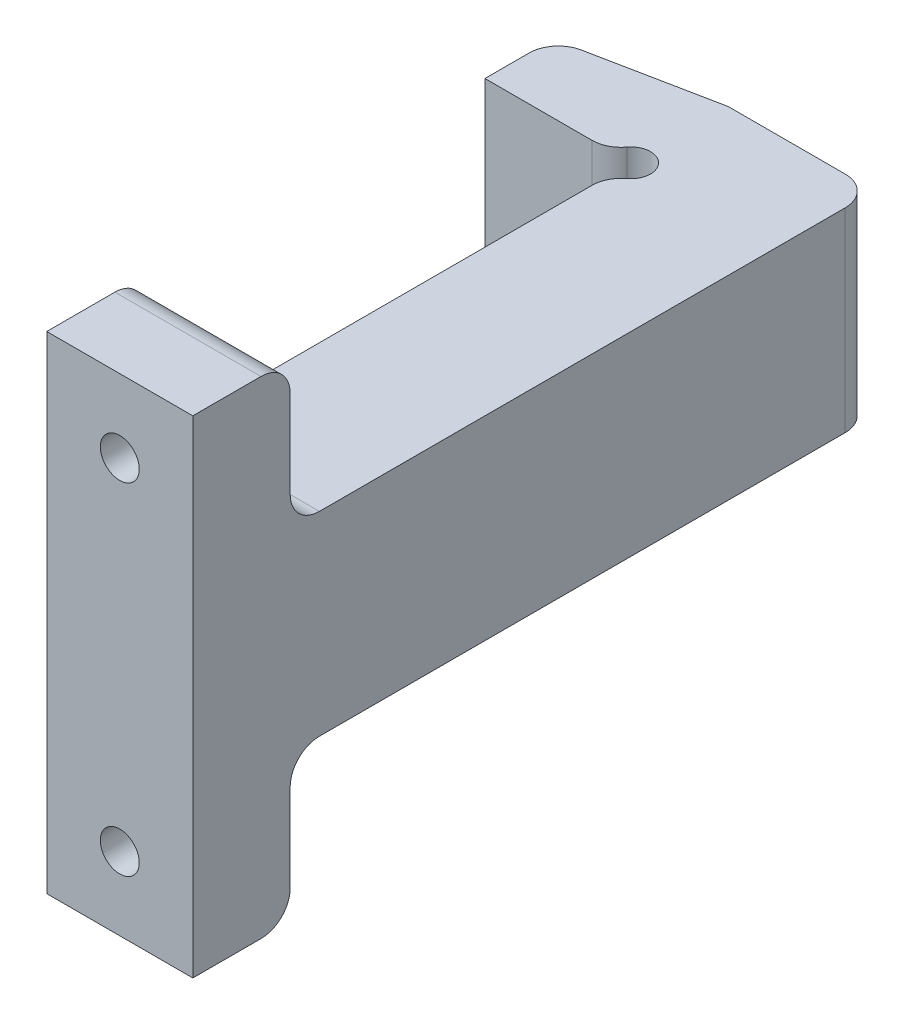
ISO-10303-21;
HEADER;
FILE_DESCRIPTION(('STEP AP214'),'2;1');
FILE_NAME('part.step','',(''),(''),'','','');
FILE_SCHEMA(('AUTOMOTIVE_DESIGN { 1 0 10303 214 1 1 1 1 }'));
ENDSEC;
DATA;
#1=APPLICATION_CONTEXT('core data for automotive mechanical design processes');
#2=APPLICATION_PROTOCOL_DEFINITION('international standard','automotive_design',2000,#1);
#3=PRODUCT_CONTEXT('',#1,'mechanical');
#4=PRODUCT('Part','Part','',(#3));
#5=PRODUCT_RELATED_PRODUCT_CATEGORY('part','',(#4));
#6=PRODUCT_DEFINITION_FORMATION('','',#4);
#7=PRODUCT_DEFINITION_CONTEXT('part definition',#1,'design');
#8=PRODUCT_DEFINITION('design','',#6,#7);
#9=PRODUCT_DEFINITION_SHAPE('','',#8);
#10=(LENGTH_UNIT() NAMED_UNIT(*) SI_UNIT(.MILLI.,.METRE.));
#11=(NAMED_UNIT(*) PLANE_ANGLE_UNIT() SI_UNIT($,.RADIAN.));
#12=(NAMED_UNIT(*) SI_UNIT($,.STERADIAN.) SOLID_ANGLE_UNIT());
#13=UNCERTAINTY_MEASURE_WITH_UNIT(LENGTH_MEASURE(1.E-05),#10,'distance_accuracy_value','');
#14=(GEOMETRIC_REPRESENTATION_CONTEXT(3) GLOBAL_UNCERTAINTY_ASSIGNED_CONTEXT((#13)) GLOBAL_UNIT_ASSIGNED_CONTEXT((#10,
#11,#12)) REPRESENTATION_CONTEXT('',''));
#15=CARTESIAN_POINT('',(0.,0.,0.));
#16=DIRECTION('',(0.,0.,1.));
#17=DIRECTION('',(1.,0.,0.));
#18=AXIS2_PLACEMENT_3D('',#15,#16,#17);
#19=CARTESIAN_POINT('',(2.,20.,0.));
#20=DIRECTION('',(0.,1.,0.));
#21=DIRECTION('',(0.,0.,1.));
#22=AXIS2_PLACEMENT_3D('',#19,#20,#21);
#23=PLANE('',#22);
#24=DIRECTION('',(1.,0.,0.));
#25=VECTOR('',#24,1.);
#26=CARTESIAN_POINT('',(0.,20.,0.));
#27=LINE('',#26,#25);
#28=CARTESIAN_POINT('',(-13.,20.,0.));
#29=VERTEX_POINT('',#28);
#30=CARTESIAN_POINT('',(-2.,20.,0.));
#31=VERTEX_POINT('',#30);
#32=EDGE_CURVE('E252',#29,#31,#27,.T.);
#33=ORIENTED_EDGE('',*,*,#32,.T.);
#34=CARTESIAN_POINT('',(-2.,20.,-3.));
#35=DIRECTION('',(0.,1.,0.));
#36=DIRECTION('',(0.,0.,1.));
#37=AXIS2_PLACEMENT_3D('',#34,#35,#36);
#38=CIRCLE('',#37,3.);
#39=CARTESIAN_POINT('',(0.4,20.,-1.2));
#40=VERTEX_POINT('',#39);
#41=EDGE_CURVE('E307',#31,#40,#38,.T.);
#42=ORIENTED_EDGE('',*,*,#41,.T.);
#43=CARTESIAN_POINT('',(2.,20.,0.));
#44=DIRECTION('',(0.,-1.,0.));
#45=DIRECTION('',(0.,0.,1.));
#46=AXIS2_PLACEMENT_3D('',#43,#44,#45);
#47=CIRCLE('',#46,2.);
#48=CARTESIAN_POINT('',(3.2,20.,1.6));
#49=VERTEX_POINT('',#48);
#50=EDGE_CURVE('E234',#40,#49,#47,.T.);
#51=ORIENTED_EDGE('',*,*,#50,.T.);
#52=CARTESIAN_POINT('',(5.,20.,4.));
#53=DIRECTION('',(0.,1.,0.));
#54=DIRECTION('',(0.,0.,1.));
#55=AXIS2_PLACEMENT_3D('',#52,#53,#54);
#56=CIRCLE('',#55,3.);
#57=CARTESIAN_POINT('',(2.,20.,4.00000000000002));
#58=VERTEX_POINT('',#57);
#59=EDGE_CURVE('E305',#49,#58,#56,.T.);
#60=ORIENTED_EDGE('',*,*,#59,.T.);
#61=DIRECTION('',(0.,0.,1.));
#62=VECTOR('',#61,1.);
#63=CARTESIAN_POINT('',(2.,20.,60.));
#64=LINE('',#63,#62);
#65=CARTESIAN_POINT('',(2.,20.,47.));
#66=VERTEX_POINT('',#65);
#67=EDGE_CURVE('E237',#58,#66,#64,.T.);
#68=ORIENTED_EDGE('',*,*,#67,.T.);
#69=DIRECTION('',(1.,0.,0.));
#70=VECTOR('',#69,1.);
#71=CARTESIAN_POINT('',(17.,20.,47.));
#72=LINE('',#71,#70);
#73=CARTESIAN_POINT('',(17.,20.,47.));
#74=VERTEX_POINT('',#73);
#75=EDGE_CURVE('E296',#66,#74,#72,.T.);
#76=ORIENTED_EDGE('',*,*,#75,.T.);
#77=DIRECTION('',(0.,0.,-1.));
#78=VECTOR('',#77,1.);
#79=CARTESIAN_POINT('',(17.,20.,-10.));
#80=LINE('',#79,#78);
#81=CARTESIAN_POINT('',(17.,20.,-7.));
#82=VERTEX_POINT('',#81);
#83=EDGE_CURVE('E241',#74,#82,#80,.T.);
#84=ORIENTED_EDGE('',*,*,#83,.T.);
#85=CARTESIAN_POINT('',(14.,20.,-7.));
#86=DIRECTION('',(0.,1.,0.));
#87=DIRECTION('',(0.,0.,1.));
#88=AXIS2_PLACEMENT_3D('',#85,#86,#87);
#89=CIRCLE('',#88,3.);
#90=CARTESIAN_POINT('',(14.,20.,-10.));
#91=VERTEX_POINT('',#90);
#92=EDGE_CURVE('E299',#82,#91,#89,.T.);
#93=ORIENTED_EDGE('',*,*,#92,.T.);
#94=DIRECTION('',(-1.,0.,0.));
#95=VECTOR('',#94,1.);
#96=CARTESIAN_POINT('',(1.99999999999999,20.,-10.));
#97=LINE('',#96,#95);
#98=CARTESIAN_POINT('',(2.29705854077835,20.,-10.));
#99=VERTEX_POINT('',#98);
#100=EDGE_CURVE('E244',#91,#99,#97,.T.);
#101=ORIENTED_EDGE('',*,*,#100,.T.);
#102=CARTESIAN_POINT('',(2.29705854077835,20.,-7.));
#103=DIRECTION('',(0.,1.,0.));
#104=DIRECTION('',(0.,0.,1.));
#105=AXIS2_PLACEMENT_3D('',#102,#103,#104);
#106=CIRCLE('',#105,3.);
#107=CARTESIAN_POINT('',(1.70871013536379,20.,-9.94174202707276));
#108=VERTEX_POINT('',#107);
#109=EDGE_CURVE('E301',#99,#108,#106,.T.);
#110=ORIENTED_EDGE('',*,*,#109,.T.);
#111=DIRECTION('',(-0.98058067569092,0.,0.196116135138184));
#112=VECTOR('',#111,1.);
#113=CARTESIAN_POINT('',(-13.,20.,-7.));
#114=LINE('',#113,#112);
#115=CARTESIAN_POINT('',(-10.5883484054146,20.,-7.48233031891709));
#116=VERTEX_POINT('',#115);
#117=EDGE_CURVE('E247',#108,#116,#114,.T.);
#118=ORIENTED_EDGE('',*,*,#117,.T.);
#119=CARTESIAN_POINT('',(-10.,20.,-4.54058829184433));
#120=DIRECTION('',(0.,1.,0.));
#121=DIRECTION('',(0.,0.,1.));
#122=AXIS2_PLACEMENT_3D('',#119,#120,#121);
#123=CIRCLE('',#122,3.);
#124=CARTESIAN_POINT('',(-13.,20.,-4.54058829184433));
#125=VERTEX_POINT('',#124);
#126=EDGE_CURVE('E303',#116,#125,#123,.T.);
#127=ORIENTED_EDGE('',*,*,#126,.T.);
#128=DIRECTION('',(0.,0.,1.));
#129=VECTOR('',#128,1.);
#130=CARTESIAN_POINT('',(-13.,20.,0.));
#131=LINE('',#130,#129);
#132=EDGE_CURVE('E250',#125,#29,#131,.T.);
#133=ORIENTED_EDGE('',*,*,#132,.T.);
#134=EDGE_LOOP('',(#33,#42,#51,#60,#68,#76,#84,#93,#101,#110,#118,#127,#133));
#135=FACE_BOUND('',#134,.T.);
#136=ADVANCED_FACE('F32',(#135),#23,.T.);
#137=CARTESIAN_POINT('',(2.,20.,0.));
#138=DIRECTION('',(0.,-1.,0.));
#139=DIRECTION('',(0.,0.,-1.));
#140=AXIS2_PLACEMENT_3D('',#137,#138,#139);
#141=CYLINDRICAL_SURFACE('',#140,2.);
#142=ORIENTED_EDGE('',*,*,#50,.F.);
#143=DIRECTION('',(0.,-1.,0.));
#144=VECTOR('',#143,1.);
#145=CARTESIAN_POINT('',(0.4,20.,-1.2));
#146=LINE('',#145,#144);
#147=CARTESIAN_POINT('',(0.4,0.,-1.2));
#148=VERTEX_POINT('',#147);
#149=EDGE_CURVE('E278',#40,#148,#146,.T.);
#150=ORIENTED_EDGE('',*,*,#149,.T.);
#151=CARTESIAN_POINT('',(2.,0.,0.));
#152=DIRECTION('',(0.,-1.,0.));
#153=DIRECTION('',(0.,0.,1.));
#154=AXIS2_PLACEMENT_3D('',#151,#152,#153);
#155=CIRCLE('',#154,2.);
#156=CARTESIAN_POINT('',(3.2,0.,1.6));
#157=VERTEX_POINT('',#156);
#158=EDGE_CURVE('E232',#148,#157,#155,.T.);
#159=ORIENTED_EDGE('',*,*,#158,.T.);
#160=DIRECTION('',(0.,-1.,0.));
#161=VECTOR('',#160,1.);
#162=CARTESIAN_POINT('',(3.2,20.,1.6));
#163=LINE('',#162,#161);
#164=EDGE_CURVE('E201',#157,#49,#163,.F.);
#165=ORIENTED_EDGE('',*,*,#164,.T.);
#166=EDGE_LOOP('',(#142,#150,#159,#165));
#167=FACE_BOUND('',#166,.T.);
#168=ADVANCED_FACE('F391',(#167),#141,.F.);
#169=CARTESIAN_POINT('',(2.,20.,60.));
#170=DIRECTION('',(1.,0.,0.));
#171=DIRECTION('',(0.,0.,-1.));
#172=AXIS2_PLACEMENT_3D('',#169,#170,#171);
#173=PLANE('',#172);
#174=ORIENTED_EDGE('',*,*,#67,.F.);
#175=DIRECTION('',(0.,-1.,0.));
#176=VECTOR('',#175,1.);
#177=CARTESIAN_POINT('',(2.,20.,4.));
#178=LINE('',#177,#176);
#179=CARTESIAN_POINT('',(2.,0.,4.00000000000002));
#180=VERTEX_POINT('',#179);
#181=EDGE_CURVE('E312',#58,#180,#178,.T.);
#182=ORIENTED_EDGE('',*,*,#181,.T.);
#183=DIRECTION('',(0.,0.,1.));
#184=VECTOR('',#183,1.);
#185=CARTESIAN_POINT('',(2.,0.,60.));
#186=LINE('',#185,#184);
#187=CARTESIAN_POINT('',(2.,0.,47.));
#188=VERTEX_POINT('',#187);
#189=EDGE_CURVE('E258',#180,#188,#186,.T.);
#190=ORIENTED_EDGE('',*,*,#189,.T.);
#191=CARTESIAN_POINT('',(2.,-3.,47.));
#192=DIRECTION('',(1.,0.,0.));
#193=DIRECTION('',(0.,0.,-1.));
#194=AXIS2_PLACEMENT_3D('',#191,#192,#193);
#195=CIRCLE('',#194,3.);
#196=CARTESIAN_POINT('',(1.99999999999999,-3.,50.));
#197=VERTEX_POINT('',#196);
#198=EDGE_CURVE('E345',#188,#197,#195,.T.);
#199=ORIENTED_EDGE('',*,*,#198,.T.);
#200=DIRECTION('',(0.,-1.,0.));
#201=VECTOR('',#200,1.);
#202=CARTESIAN_POINT('',(1.99999999999999,0.,50.));
#203=LINE('',#202,#201);
#204=CARTESIAN_POINT('',(1.99999999999999,-12.,50.));
#205=VERTEX_POINT('',#204);
#206=EDGE_CURVE('E207',#197,#205,#203,.T.);
#207=ORIENTED_EDGE('',*,*,#206,.T.);
#208=CARTESIAN_POINT('',(2.,-12.,53.));
#209=DIRECTION('',(1.,0.,0.));
#210=DIRECTION('',(0.,0.,-1.));
#211=AXIS2_PLACEMENT_3D('',#208,#209,#210);
#212=CIRCLE('',#211,3.);
#213=CARTESIAN_POINT('',(1.99999999999999,-15.,53.));
#214=VERTEX_POINT('',#213);
#215=EDGE_CURVE('E185',#205,#214,#212,.F.);
#216=ORIENTED_EDGE('',*,*,#215,.T.);
#217=DIRECTION('',(0.,0.,1.));
#218=VECTOR('',#217,1.);
#219=CARTESIAN_POINT('',(1.99999999999999,-15.,50.));
#220=LINE('',#219,#218);
#221=CARTESIAN_POINT('',(1.99999999999999,-15.,60.));
#222=VERTEX_POINT('',#221);
#223=EDGE_CURVE('E176',#214,#222,#220,.T.);
#224=ORIENTED_EDGE('',*,*,#223,.T.);
#225=DIRECTION('',(0.,-1.,0.));
#226=VECTOR('',#225,1.);
#227=CARTESIAN_POINT('',(2.,20.,60.));
#228=LINE('',#227,#226);
#229=CARTESIAN_POINT('',(1.99999999999999,35.,60.));
#230=VERTEX_POINT('',#229);
#231=EDGE_CURVE('E181',#230,#222,#228,.T.);
#232=ORIENTED_EDGE('',*,*,#231,.F.);
#233=DIRECTION('',(0.,0.,1.));
#234=VECTOR('',#233,1.);
#235=CARTESIAN_POINT('',(1.99999999999999,35.,50.));
#236=LINE('',#235,#234);
#237=CARTESIAN_POINT('',(1.99999999999999,35.,53.));
#238=VERTEX_POINT('',#237);
#239=EDGE_CURVE('E230',#238,#230,#236,.T.);
#240=ORIENTED_EDGE('',*,*,#239,.F.);
#241=CARTESIAN_POINT('',(2.,32.,53.));
#242=DIRECTION('',(1.,0.,0.));
#243=DIRECTION('',(0.,0.,-1.));
#244=AXIS2_PLACEMENT_3D('',#241,#242,#243);
#245=CIRCLE('',#244,3.);
#246=CARTESIAN_POINT('',(1.99999999999999,32.,50.));
#247=VERTEX_POINT('',#246);
#248=EDGE_CURVE('E309',#238,#247,#245,.F.);
#249=ORIENTED_EDGE('',*,*,#248,.T.);
#250=DIRECTION('',(0.,-1.,0.));
#251=VECTOR('',#250,1.);
#252=CARTESIAN_POINT('',(1.99999999999999,20.,50.));
#253=LINE('',#252,#251);
#254=CARTESIAN_POINT('',(1.99999999999999,23.,50.));
#255=VERTEX_POINT('',#254);
#256=EDGE_CURVE('E223',#247,#255,#253,.T.);
#257=ORIENTED_EDGE('',*,*,#256,.T.);
#258=CARTESIAN_POINT('',(2.,23.,47.));
#259=DIRECTION('',(1.,0.,0.));
#260=DIRECTION('',(0.,0.,-1.));
#261=AXIS2_PLACEMENT_3D('',#258,#259,#260);
#262=CIRCLE('',#261,3.);
#263=EDGE_CURVE('E11',#255,#66,#262,.T.);
#264=ORIENTED_EDGE('',*,*,#263,.T.);
#265=EDGE_LOOP('',(#174,#182,#190,#199,#207,#216,#224,#232,#240,#249,#257,#264));
#266=FACE_BOUND('',#265,.T.);
#267=ADVANCED_FACE('F179',(#266),#173,.F.);
#268=CARTESIAN_POINT('',(17.,20.,60.));
#269=DIRECTION('',(0.,0.,-1.));
#270=DIRECTION('',(-1.,0.,0.));
#271=AXIS2_PLACEMENT_3D('',#268,#269,#270);
#272=PLANE('',#271);
#273=ORIENTED_EDGE('',*,*,#231,.T.);
#274=DIRECTION('',(1.,0.,0.));
#275=VECTOR('',#274,1.);
#276=CARTESIAN_POINT('',(1.99999999999999,-15.,60.));
#277=LINE('',#276,#275);
#278=CARTESIAN_POINT('',(17.,-15.,60.));
#279=VERTEX_POINT('',#278);
#280=EDGE_CURVE('E198',#222,#279,#277,.T.);
#281=ORIENTED_EDGE('',*,*,#280,.T.);
#282=DIRECTION('',(0.,-1.,0.));
#283=VECTOR('',#282,1.);
#284=CARTESIAN_POINT('',(17.,20.,60.));
#285=LINE('',#284,#283);
#286=CARTESIAN_POINT('',(17.,35.,60.));
#287=VERTEX_POINT('',#286);
#288=EDGE_CURVE('E202',#287,#279,#285,.T.);
#289=ORIENTED_EDGE('',*,*,#288,.F.);
#290=DIRECTION('',(-1.,0.,0.));
#291=VECTOR('',#290,1.);
#292=CARTESIAN_POINT('',(1.99999999999999,35.,60.));
#293=LINE('',#292,#291);
#294=EDGE_CURVE('E200',#287,#230,#293,.T.);
#295=ORIENTED_EDGE('',*,*,#294,.T.);
#296=EDGE_LOOP('',(#273,#281,#289,#295));
#297=FACE_BOUND('',#296,.T.);
#298=CARTESIAN_POINT('',(9.5,27.5,60.));
#299=DIRECTION('',(0.,0.,1.));
#300=DIRECTION('',(1.,0.,0.));
#301=AXIS2_PLACEMENT_3D('',#298,#299,#300);
#302=CIRCLE('',#301,2.);
#303=CARTESIAN_POINT('',(11.5,27.5,60.));
#304=VERTEX_POINT('',#303);
#305=EDGE_CURVE('E216',#304,#304,#302,.T.);
#306=ORIENTED_EDGE('',*,*,#305,.F.);
#307=EDGE_LOOP('',(#306));
#308=FACE_BOUND('',#307,.T.);
#309=CARTESIAN_POINT('',(9.5,-7.5,60.));
#310=DIRECTION('',(0.,0.,1.));
#311=DIRECTION('',(-1.,0.,0.));
#312=AXIS2_PLACEMENT_3D('',#309,#310,#311);
#313=CIRCLE('',#312,2.);
#314=CARTESIAN_POINT('',(7.5,-7.5,60.));
#315=VERTEX_POINT('',#314);
#316=EDGE_CURVE('E212',#315,#315,#313,.T.);
#317=ORIENTED_EDGE('',*,*,#316,.F.);
#318=EDGE_LOOP('',(#317));
#319=FACE_BOUND('',#318,.T.);
#320=ADVANCED_FACE('F195',(#297,#308,#319),#272,.F.);
#321=CARTESIAN_POINT('',(17.,20.,-10.));
#322=DIRECTION('',(-1.,0.,0.));
#323=DIRECTION('',(0.,0.,1.));
#324=AXIS2_PLACEMENT_3D('',#321,#322,#323);
#325=PLANE('',#324);
#326=DIRECTION('',(0.,0.,1.));
#327=VECTOR('',#326,1.);
#328=CARTESIAN_POINT('',(17.,-15.,50.));
#329=LINE('',#328,#327);
#330=CARTESIAN_POINT('',(17.,-15.,53.));
#331=VERTEX_POINT('',#330);
#332=EDGE_CURVE('E190',#331,#279,#329,.T.);
#333=ORIENTED_EDGE('',*,*,#332,.F.);
#334=CARTESIAN_POINT('',(17.,-12.,53.));
#335=DIRECTION('',(-1.,0.,0.));
#336=DIRECTION('',(0.,0.,1.));
#337=AXIS2_PLACEMENT_3D('',#334,#335,#336);
#338=CIRCLE('',#337,3.);
#339=CARTESIAN_POINT('',(17.,-12.,50.));
#340=VERTEX_POINT('',#339);
#341=EDGE_CURVE('E320',#331,#340,#338,.F.);
#342=ORIENTED_EDGE('',*,*,#341,.T.);
#343=DIRECTION('',(0.,1.,0.));
#344=VECTOR('',#343,1.);
#345=CARTESIAN_POINT('',(17.,0.,50.));
#346=LINE('',#345,#344);
#347=CARTESIAN_POINT('',(17.,-3.,50.));
#348=VERTEX_POINT('',#347);
#349=EDGE_CURVE('E191',#340,#348,#346,.T.);
#350=ORIENTED_EDGE('',*,*,#349,.T.);
#351=CARTESIAN_POINT('',(17.,-3.,47.));
#352=DIRECTION('',(-1.,0.,0.));
#353=DIRECTION('',(0.,0.,1.));
#354=AXIS2_PLACEMENT_3D('',#351,#352,#353);
#355=CIRCLE('',#354,3.);
#356=CARTESIAN_POINT('',(17.,0.,47.));
#357=VERTEX_POINT('',#356);
#358=EDGE_CURVE('E347',#348,#357,#355,.T.);
#359=ORIENTED_EDGE('',*,*,#358,.T.);
#360=DIRECTION('',(0.,0.,-1.));
#361=VECTOR('',#360,1.);
#362=CARTESIAN_POINT('',(17.,0.,-10.));
#363=LINE('',#362,#361);
#364=CARTESIAN_POINT('',(17.,0.,-7.));
#365=VERTEX_POINT('',#364);
#366=EDGE_CURVE('E261',#357,#365,#363,.T.);
#367=ORIENTED_EDGE('',*,*,#366,.T.);
#368=DIRECTION('',(0.,-1.,0.));
#369=VECTOR('',#368,1.);
#370=CARTESIAN_POINT('',(17.,20.,-7.));
#371=LINE('',#370,#369);
#372=EDGE_CURVE('E318',#365,#82,#371,.F.);
#373=ORIENTED_EDGE('',*,*,#372,.T.);
#374=ORIENTED_EDGE('',*,*,#83,.F.);
#375=CARTESIAN_POINT('',(17.,23.,47.));
#376=DIRECTION('',(-1.,0.,0.));
#377=DIRECTION('',(0.,0.,1.));
#378=AXIS2_PLACEMENT_3D('',#375,#376,#377);
#379=CIRCLE('',#378,3.);
#380=CARTESIAN_POINT('',(17.,23.,50.));
#381=VERTEX_POINT('',#380);
#382=EDGE_CURVE('E40',#74,#381,#379,.T.);
#383=ORIENTED_EDGE('',*,*,#382,.T.);
#384=DIRECTION('',(0.,1.,0.));
#385=VECTOR('',#384,1.);
#386=CARTESIAN_POINT('',(17.,20.,50.));
#387=LINE('',#386,#385);
#388=CARTESIAN_POINT('',(17.,32.,50.));
#389=VERTEX_POINT('',#388);
#390=EDGE_CURVE('E226',#381,#389,#387,.T.);
#391=ORIENTED_EDGE('',*,*,#390,.T.);
#392=CARTESIAN_POINT('',(17.,32.,53.));
#393=DIRECTION('',(-1.,0.,0.));
#394=DIRECTION('',(0.,0.,1.));
#395=AXIS2_PLACEMENT_3D('',#392,#393,#394);
#396=CIRCLE('',#395,3.);
#397=CARTESIAN_POINT('',(17.,35.,53.));
#398=VERTEX_POINT('',#397);
#399=EDGE_CURVE('E47',#389,#398,#396,.F.);
#400=ORIENTED_EDGE('',*,*,#399,.T.);
#401=DIRECTION('',(0.,0.,1.));
#402=VECTOR('',#401,1.);
#403=CARTESIAN_POINT('',(17.,35.,50.));
#404=LINE('',#403,#402);
#405=EDGE_CURVE('E228',#398,#287,#404,.T.);
#406=ORIENTED_EDGE('',*,*,#405,.T.);
#407=ORIENTED_EDGE('',*,*,#288,.T.);
#408=EDGE_LOOP('',(#333,#342,#350,#359,#367,#373,#374,#383,#391,#400,#406,#407));
#409=FACE_BOUND('',#408,.T.);
#410=ADVANCED_FACE('F349',(#409),#325,.F.);
#411=CARTESIAN_POINT('',(1.99999999999999,20.,-10.));
#412=DIRECTION('',(0.,0.,1.));
#413=DIRECTION('',(1.,0.,0.));
#414=AXIS2_PLACEMENT_3D('',#411,#412,#413);
#415=PLANE('',#414);
#416=DIRECTION('',(-1.,0.,0.));
#417=VECTOR('',#416,1.);
#418=CARTESIAN_POINT('',(1.99999999999999,0.,-10.));
#419=LINE('',#418,#417);
#420=CARTESIAN_POINT('',(14.,0.,-10.));
#421=VERTEX_POINT('',#420);
#422=CARTESIAN_POINT('',(2.29705854077835,0.,-10.));
#423=VERTEX_POINT('',#422);
#424=EDGE_CURVE('E264',#421,#423,#419,.T.);
#425=ORIENTED_EDGE('',*,*,#424,.T.);
#426=DIRECTION('',(0.,-1.,0.));
#427=VECTOR('',#426,1.);
#428=CARTESIAN_POINT('',(2.29705854077835,20.,-10.));
#429=LINE('',#428,#427);
#430=EDGE_CURVE('E337',#423,#99,#429,.F.);
#431=ORIENTED_EDGE('',*,*,#430,.T.);
#432=ORIENTED_EDGE('',*,*,#100,.F.);
#433=DIRECTION('',(0.,-1.,0.));
#434=VECTOR('',#433,1.);
#435=CARTESIAN_POINT('',(14.,20.,-10.));
#436=LINE('',#435,#434);
#437=EDGE_CURVE('E334',#91,#421,#436,.T.);
#438=ORIENTED_EDGE('',*,*,#437,.T.);
#439=EDGE_LOOP('',(#425,#431,#432,#438));
#440=FACE_BOUND('',#439,.T.);
#441=ADVANCED_FACE('F414',(#440),#415,.F.);
#442=CARTESIAN_POINT('',(-13.,20.,-7.));
#443=DIRECTION('',(0.196116135138184,0.,0.98058067569092));
#444=DIRECTION('',(0.98058067569092,0.,-0.196116135138184));
#445=AXIS2_PLACEMENT_3D('',#442,#443,#444);
#446=PLANE('',#445);
#447=DIRECTION('',(-0.98058067569092,0.,0.196116135138184));
#448=VECTOR('',#447,1.);
#449=CARTESIAN_POINT('',(-13.,0.,-7.));
#450=LINE('',#449,#448);
#451=CARTESIAN_POINT('',(1.70871013536379,0.,-9.94174202707276));
#452=VERTEX_POINT('',#451);
#453=CARTESIAN_POINT('',(-10.5883484054146,0.,-7.48233031891709));
#454=VERTEX_POINT('',#453);
#455=EDGE_CURVE('E267',#452,#454,#450,.T.);
#456=ORIENTED_EDGE('',*,*,#455,.T.);
#457=DIRECTION('',(0.,-1.,0.));
#458=VECTOR('',#457,1.);
#459=CARTESIAN_POINT('',(-10.5883484054145,20.,-7.48233031891709));
#460=LINE('',#459,#458);
#461=EDGE_CURVE('E332',#454,#116,#460,.F.);
#462=ORIENTED_EDGE('',*,*,#461,.T.);
#463=ORIENTED_EDGE('',*,*,#117,.F.);
#464=DIRECTION('',(0.,-1.,0.));
#465=VECTOR('',#464,1.);
#466=CARTESIAN_POINT('',(1.7087101353638,20.,-9.94174202707276));
#467=LINE('',#466,#465);
#468=EDGE_CURVE('E329',#108,#452,#467,.T.);
#469=ORIENTED_EDGE('',*,*,#468,.T.);
#470=EDGE_LOOP('',(#456,#462,#463,#469));
#471=FACE_BOUND('',#470,.T.);
#472=ADVANCED_FACE('F410',(#471),#446,.F.);
#473=CARTESIAN_POINT('',(-13.,20.,0.));
#474=DIRECTION('',(1.,0.,0.));
#475=DIRECTION('',(0.,0.,-1.));
#476=AXIS2_PLACEMENT_3D('',#473,#474,#475);
#477=PLANE('',#476);
#478=ORIENTED_EDGE('',*,*,#132,.F.);
#479=DIRECTION('',(0.,-1.,0.));
#480=VECTOR('',#479,1.);
#481=CARTESIAN_POINT('',(-13.,20.,-4.54058829184433));
#482=LINE('',#481,#480);
#483=CARTESIAN_POINT('',(-13.,0.,-4.54058829184433));
#484=VERTEX_POINT('',#483);
#485=EDGE_CURVE('E326',#125,#484,#482,.T.);
#486=ORIENTED_EDGE('',*,*,#485,.T.);
#487=DIRECTION('',(0.,0.,1.));
#488=VECTOR('',#487,1.);
#489=CARTESIAN_POINT('',(-13.,0.,0.));
#490=LINE('',#489,#488);
#491=CARTESIAN_POINT('',(-13.,0.,0.));
#492=VERTEX_POINT('',#491);
#493=EDGE_CURVE('E270',#484,#492,#490,.T.);
#494=ORIENTED_EDGE('',*,*,#493,.T.);
#495=DIRECTION('',(0.,-1.,0.));
#496=VECTOR('',#495,1.);
#497=CARTESIAN_POINT('',(-13.,20.,0.));
#498=LINE('',#497,#496);
#499=EDGE_CURVE('E255',#29,#492,#498,.T.);
#500=ORIENTED_EDGE('',*,*,#499,.F.);
#501=EDGE_LOOP('',(#478,#486,#494,#500));
#502=FACE_BOUND('',#501,.T.);
#503=ADVANCED_FACE('F406',(#502),#477,.F.);
#504=CARTESIAN_POINT('',(0.,20.,0.));
#505=DIRECTION('',(0.,0.,-1.));
#506=DIRECTION('',(-1.,0.,0.));
#507=AXIS2_PLACEMENT_3D('',#504,#505,#506);
#508=PLANE('',#507);
#509=DIRECTION('',(1.,0.,0.));
#510=VECTOR('',#509,1.);
#511=CARTESIAN_POINT('',(0.,0.,0.));
#512=LINE('',#511,#510);
#513=CARTESIAN_POINT('',(-2.,0.,0.));
#514=VERTEX_POINT('',#513);
#515=EDGE_CURVE('E238',#492,#514,#512,.T.);
#516=ORIENTED_EDGE('',*,*,#515,.T.);
#517=DIRECTION('',(0.,-1.,0.));
#518=VECTOR('',#517,1.);
#519=CARTESIAN_POINT('',(-2.,20.,0.));
#520=LINE('',#519,#518);
#521=EDGE_CURVE('E294',#514,#31,#520,.F.);
#522=ORIENTED_EDGE('',*,*,#521,.T.);
#523=ORIENTED_EDGE('',*,*,#32,.F.);
#524=ORIENTED_EDGE('',*,*,#499,.T.);
#525=EDGE_LOOP('',(#516,#522,#523,#524));
#526=FACE_BOUND('',#525,.T.);
#527=ADVANCED_FACE('F403',(#526),#508,.F.);
#528=CARTESIAN_POINT('',(2.,0.,0.));
#529=DIRECTION('',(0.,1.,0.));
#530=DIRECTION('',(0.,0.,1.));
#531=AXIS2_PLACEMENT_3D('',#528,#529,#530);
#532=PLANE('',#531);
#533=ORIENTED_EDGE('',*,*,#158,.F.);
#534=CARTESIAN_POINT('',(-2.,0.,-3.));
#535=DIRECTION('',(0.,1.,0.));
#536=DIRECTION('',(0.,0.,1.));
#537=AXIS2_PLACEMENT_3D('',#534,#535,#536);
#538=CIRCLE('',#537,3.);
#539=EDGE_CURVE('E292',#148,#514,#538,.F.);
#540=ORIENTED_EDGE('',*,*,#539,.T.);
#541=ORIENTED_EDGE('',*,*,#515,.F.);
#542=ORIENTED_EDGE('',*,*,#493,.F.);
#543=CARTESIAN_POINT('',(-10.,0.,-4.54058829184433));
#544=DIRECTION('',(0.,1.,0.));
#545=DIRECTION('',(0.,0.,1.));
#546=AXIS2_PLACEMENT_3D('',#543,#544,#545);
#547=CIRCLE('',#546,3.);
#548=EDGE_CURVE('E285',#484,#454,#547,.F.);
#549=ORIENTED_EDGE('',*,*,#548,.T.);
#550=ORIENTED_EDGE('',*,*,#455,.F.);
#551=CARTESIAN_POINT('',(2.29705854077835,0.,-7.));
#552=DIRECTION('',(0.,1.,0.));
#553=DIRECTION('',(0.,0.,1.));
#554=AXIS2_PLACEMENT_3D('',#551,#552,#553);
#555=CIRCLE('',#554,3.);
#556=EDGE_CURVE('E283',#452,#423,#555,.F.);
#557=ORIENTED_EDGE('',*,*,#556,.T.);
#558=ORIENTED_EDGE('',*,*,#424,.F.);
#559=CARTESIAN_POINT('',(14.,0.,-7.));
#560=DIRECTION('',(0.,1.,0.));
#561=DIRECTION('',(0.,0.,1.));
#562=AXIS2_PLACEMENT_3D('',#559,#560,#561);
#563=CIRCLE('',#562,3.);
#564=EDGE_CURVE('E281',#421,#365,#563,.F.);
#565=ORIENTED_EDGE('',*,*,#564,.T.);
#566=ORIENTED_EDGE('',*,*,#366,.F.);
#567=DIRECTION('',(-1.,0.,0.));
#568=VECTOR('',#567,1.);
#569=CARTESIAN_POINT('',(2.,0.,47.));
#570=LINE('',#569,#568);
#571=EDGE_CURVE('E287',#357,#188,#570,.T.);
#572=ORIENTED_EDGE('',*,*,#571,.T.);
#573=ORIENTED_EDGE('',*,*,#189,.F.);
#574=CARTESIAN_POINT('',(5.,0.,4.));
#575=DIRECTION('',(0.,1.,0.));
#576=DIRECTION('',(0.,0.,1.));
#577=AXIS2_PLACEMENT_3D('',#574,#575,#576);
#578=CIRCLE('',#577,3.);
#579=EDGE_CURVE('E290',#180,#157,#578,.F.);
#580=ORIENTED_EDGE('',*,*,#579,.T.);
#581=EDGE_LOOP('',(#533,#540,#541,#542,#549,#550,#557,#558,#565,#566,#572,#573,#580));
#582=FACE_BOUND('',#581,.T.);
#583=ADVANCED_FACE('F366',(#582),#532,.F.);
#584=CARTESIAN_POINT('',(1.99999999999999,35.,50.));
#585=DIRECTION('',(0.,1.,0.));
#586=DIRECTION('',(0.,0.,1.));
#587=AXIS2_PLACEMENT_3D('',#584,#585,#586);
#588=PLANE('',#587);
#589=ORIENTED_EDGE('',*,*,#405,.F.);
#590=DIRECTION('',(-1.,0.,0.));
#591=VECTOR('',#590,1.);
#592=CARTESIAN_POINT('',(1.99999999999999,35.,53.));
#593=LINE('',#592,#591);
#594=EDGE_CURVE('E342',#398,#238,#593,.T.);
#595=ORIENTED_EDGE('',*,*,#594,.T.);
#596=ORIENTED_EDGE('',*,*,#239,.T.);
#597=ORIENTED_EDGE('',*,*,#294,.F.);
#598=EDGE_LOOP('',(#589,#595,#596,#597));
#599=FACE_BOUND('',#598,.T.);
#600=ADVANCED_FACE('F382',(#599),#588,.T.);
#601=CARTESIAN_POINT('',(0.,0.,50.));
#602=DIRECTION('',(0.,0.,-1.));
#603=DIRECTION('',(-1.,0.,0.));
#604=AXIS2_PLACEMENT_3D('',#601,#602,#603);
#605=PLANE('',#604);
#606=CARTESIAN_POINT('',(9.5,27.5,50.));
#607=DIRECTION('',(0.,0.,1.));
#608=DIRECTION('',(1.,0.,0.));
#609=AXIS2_PLACEMENT_3D('',#606,#607,#608);
#610=CIRCLE('',#609,2.);
#611=CARTESIAN_POINT('',(11.5,27.5,50.));
#612=VERTEX_POINT('',#611);
#613=EDGE_CURVE('E218',#612,#612,#610,.T.);
#614=ORIENTED_EDGE('',*,*,#613,.T.);
#615=EDGE_LOOP('',(#614));
#616=FACE_BOUND('',#615,.T.);
#617=ORIENTED_EDGE('',*,*,#390,.F.);
#618=DIRECTION('',(1.,0.,0.));
#619=VECTOR('',#618,1.);
#620=CARTESIAN_POINT('',(1.99999999999999,23.,50.));
#621=LINE('',#620,#619);
#622=EDGE_CURVE('E340',#381,#255,#621,.F.);
#623=ORIENTED_EDGE('',*,*,#622,.T.);
#624=ORIENTED_EDGE('',*,*,#256,.F.);
#625=DIRECTION('',(-1.,0.,0.));
#626=VECTOR('',#625,1.);
#627=CARTESIAN_POINT('',(0.,32.,50.));
#628=LINE('',#627,#626);
#629=EDGE_CURVE('E55',#247,#389,#628,.F.);
#630=ORIENTED_EDGE('',*,*,#629,.T.);
#631=EDGE_LOOP('',(#617,#623,#624,#630));
#632=FACE_BOUND('',#631,.T.);
#633=ADVANCED_FACE('F353',(#616,#632),#605,.T.);
#634=CARTESIAN_POINT('',(9.5,27.5,50.));
#635=DIRECTION('',(0.,0.,1.));
#636=DIRECTION('',(1.,0.,0.));
#637=AXIS2_PLACEMENT_3D('',#634,#635,#636);
#638=CYLINDRICAL_SURFACE('',#637,2.);
#639=ORIENTED_EDGE('',*,*,#613,.F.);
#640=EDGE_LOOP('',(#639));
#641=FACE_BOUND('',#640,.T.);
#642=ORIENTED_EDGE('',*,*,#305,.T.);
#643=EDGE_LOOP('',(#642));
#644=FACE_BOUND('',#643,.T.);
#645=ADVANCED_FACE('F537',(#641,#644),#638,.F.);
#646=CARTESIAN_POINT('',(1.99999999999999,-15.,50.));
#647=DIRECTION('',(0.,-1.,0.));
#648=DIRECTION('',(0.,0.,-1.));
#649=AXIS2_PLACEMENT_3D('',#646,#647,#648);
#650=PLANE('',#649);
#651=ORIENTED_EDGE('',*,*,#223,.F.);
#652=DIRECTION('',(1.,0.,0.));
#653=VECTOR('',#652,1.);
#654=CARTESIAN_POINT('',(1.99999999999999,-15.,53.));
#655=LINE('',#654,#653);
#656=EDGE_CURVE('E315',#214,#331,#655,.T.);
#657=ORIENTED_EDGE('',*,*,#656,.T.);
#658=ORIENTED_EDGE('',*,*,#332,.T.);
#659=ORIENTED_EDGE('',*,*,#280,.F.);
#660=EDGE_LOOP('',(#651,#657,#658,#659));
#661=FACE_BOUND('',#660,.T.);
#662=ADVANCED_FACE('F204',(#661),#650,.T.);
#663=CARTESIAN_POINT('',(0.,0.,50.));
#664=DIRECTION('',(0.,0.,-1.));
#665=DIRECTION('',(-1.,0.,0.));
#666=AXIS2_PLACEMENT_3D('',#663,#664,#665);
#667=PLANE('',#666);
#668=CARTESIAN_POINT('',(9.5,-7.5,50.));
#669=DIRECTION('',(0.,0.,1.));
#670=DIRECTION('',(-1.,0.,0.));
#671=AXIS2_PLACEMENT_3D('',#668,#669,#670);
#672=CIRCLE('',#671,2.);
#673=CARTESIAN_POINT('',(7.5,-7.5,50.));
#674=VERTEX_POINT('',#673);
#675=EDGE_CURVE('E208',#674,#674,#672,.T.);
#676=ORIENTED_EDGE('',*,*,#675,.T.);
#677=EDGE_LOOP('',(#676));
#678=FACE_BOUND('',#677,.T.);
#679=ORIENTED_EDGE('',*,*,#349,.F.);
#680=DIRECTION('',(1.,0.,0.));
#681=VECTOR('',#680,1.);
#682=CARTESIAN_POINT('',(0.,-12.,50.));
#683=LINE('',#682,#681);
#684=EDGE_CURVE('E324',#340,#205,#683,.F.);
#685=ORIENTED_EDGE('',*,*,#684,.T.);
#686=ORIENTED_EDGE('',*,*,#206,.F.);
#687=DIRECTION('',(-1.,0.,0.));
#688=VECTOR('',#687,1.);
#689=CARTESIAN_POINT('',(0.,-3.,50.));
#690=LINE('',#689,#688);
#691=EDGE_CURVE('E322',#197,#348,#690,.F.);
#692=ORIENTED_EDGE('',*,*,#691,.T.);
#693=EDGE_LOOP('',(#679,#685,#686,#692));
#694=FACE_BOUND('',#693,.T.);
#695=ADVANCED_FACE('F376',(#678,#694),#667,.T.);
#696=CARTESIAN_POINT('',(9.5,-7.5,50.));
#697=DIRECTION('',(0.,0.,1.));
#698=DIRECTION('',(1.,0.,0.));
#699=AXIS2_PLACEMENT_3D('',#696,#697,#698);
#700=CYLINDRICAL_SURFACE('',#699,2.);
#701=ORIENTED_EDGE('',*,*,#675,.F.);
#702=EDGE_LOOP('',(#701));
#703=FACE_BOUND('',#702,.T.);
#704=ORIENTED_EDGE('',*,*,#316,.T.);
#705=EDGE_LOOP('',(#704));
#706=FACE_BOUND('',#705,.T.);
#707=ADVANCED_FACE('F428',(#703,#706),#700,.F.);
#708=CARTESIAN_POINT('',(-2.,20.,-3.));
#709=DIRECTION('',(0.,-1.,0.));
#710=DIRECTION('',(0.,0.,-1.));
#711=AXIS2_PLACEMENT_3D('',#708,#709,#710);
#712=CYLINDRICAL_SURFACE('',#711,3.);
#713=ORIENTED_EDGE('',*,*,#41,.F.);
#714=ORIENTED_EDGE('',*,*,#521,.F.);
#715=ORIENTED_EDGE('',*,*,#539,.F.);
#716=ORIENTED_EDGE('',*,*,#149,.F.);
#717=EDGE_LOOP('',(#713,#714,#715,#716));
#718=FACE_BOUND('',#717,.T.);
#719=ADVANCED_FACE('F425',(#718),#712,.T.);
#720=CARTESIAN_POINT('',(5.,20.,4.));
#721=DIRECTION('',(0.,-1.,0.));
#722=DIRECTION('',(0.,0.,-1.));
#723=AXIS2_PLACEMENT_3D('',#720,#721,#722);
#724=CYLINDRICAL_SURFACE('',#723,3.);
#725=ORIENTED_EDGE('',*,*,#59,.F.);
#726=ORIENTED_EDGE('',*,*,#164,.F.);
#727=ORIENTED_EDGE('',*,*,#579,.F.);
#728=ORIENTED_EDGE('',*,*,#181,.F.);
#729=EDGE_LOOP('',(#725,#726,#727,#728));
#730=FACE_BOUND('',#729,.T.);
#731=ADVANCED_FACE('F362',(#730),#724,.T.);
#732=CARTESIAN_POINT('',(1.99999999999999,-12.,53.));
#733=DIRECTION('',(1.,0.,0.));
#734=DIRECTION('',(0.,0.,-1.));
#735=AXIS2_PLACEMENT_3D('',#732,#733,#734);
#736=CYLINDRICAL_SURFACE('',#735,3.);
#737=ORIENTED_EDGE('',*,*,#215,.F.);
#738=ORIENTED_EDGE('',*,*,#684,.F.);
#739=ORIENTED_EDGE('',*,*,#341,.F.);
#740=ORIENTED_EDGE('',*,*,#656,.F.);
#741=EDGE_LOOP('',(#737,#738,#739,#740));
#742=FACE_BOUND('',#741,.T.);
#743=ADVANCED_FACE('F380',(#742),#736,.T.);
#744=CARTESIAN_POINT('',(2.,-3.,47.));
#745=DIRECTION('',(-1.,0.,0.));
#746=DIRECTION('',(0.,0.,1.));
#747=AXIS2_PLACEMENT_3D('',#744,#745,#746);
#748=CYLINDRICAL_SURFACE('',#747,3.);
#749=ORIENTED_EDGE('',*,*,#358,.F.);
#750=ORIENTED_EDGE('',*,*,#691,.F.);
#751=ORIENTED_EDGE('',*,*,#198,.F.);
#752=ORIENTED_EDGE('',*,*,#571,.F.);
#753=EDGE_LOOP('',(#749,#750,#751,#752));
#754=FACE_BOUND('',#753,.T.);
#755=ADVANCED_FACE('F371',(#754),#748,.F.);
#756=CARTESIAN_POINT('',(-10.,20.,-4.54058829184433));
#757=DIRECTION('',(0.,-1.,0.));
#758=DIRECTION('',(0.,0.,-1.));
#759=AXIS2_PLACEMENT_3D('',#756,#757,#758);
#760=CYLINDRICAL_SURFACE('',#759,3.);
#761=ORIENTED_EDGE('',*,*,#126,.F.);
#762=ORIENTED_EDGE('',*,*,#461,.F.);
#763=ORIENTED_EDGE('',*,*,#548,.F.);
#764=ORIENTED_EDGE('',*,*,#485,.F.);
#765=EDGE_LOOP('',(#761,#762,#763,#764));
#766=FACE_BOUND('',#765,.T.);
#767=ADVANCED_FACE('F436',(#766),#760,.T.);
#768=CARTESIAN_POINT('',(2.29705854077835,20.,-7.));
#769=DIRECTION('',(0.,-1.,0.));
#770=DIRECTION('',(0.,0.,-1.));
#771=AXIS2_PLACEMENT_3D('',#768,#769,#770);
#772=CYLINDRICAL_SURFACE('',#771,3.);
#773=ORIENTED_EDGE('',*,*,#109,.F.);
#774=ORIENTED_EDGE('',*,*,#430,.F.);
#775=ORIENTED_EDGE('',*,*,#556,.F.);
#776=ORIENTED_EDGE('',*,*,#468,.F.);
#777=EDGE_LOOP('',(#773,#774,#775,#776));
#778=FACE_BOUND('',#777,.T.);
#779=ADVANCED_FACE('F439',(#778),#772,.T.);
#780=CARTESIAN_POINT('',(14.,20.,-7.));
#781=DIRECTION('',(0.,-1.,0.));
#782=DIRECTION('',(0.,0.,-1.));
#783=AXIS2_PLACEMENT_3D('',#780,#781,#782);
#784=CYLINDRICAL_SURFACE('',#783,3.);
#785=ORIENTED_EDGE('',*,*,#92,.F.);
#786=ORIENTED_EDGE('',*,*,#372,.F.);
#787=ORIENTED_EDGE('',*,*,#564,.F.);
#788=ORIENTED_EDGE('',*,*,#437,.F.);
#789=EDGE_LOOP('',(#785,#786,#787,#788));
#790=FACE_BOUND('',#789,.T.);
#791=ADVANCED_FACE('F389',(#790),#784,.T.);
#792=CARTESIAN_POINT('',(2.,23.,47.));
#793=DIRECTION('',(-1.,0.,0.));
#794=DIRECTION('',(0.,0.,1.));
#795=AXIS2_PLACEMENT_3D('',#792,#793,#794);
#796=CYLINDRICAL_SURFACE('',#795,3.);
#797=ORIENTED_EDGE('',*,*,#263,.F.);
#798=ORIENTED_EDGE('',*,*,#622,.F.);
#799=ORIENTED_EDGE('',*,*,#382,.F.);
#800=ORIENTED_EDGE('',*,*,#75,.F.);
#801=EDGE_LOOP('',(#797,#798,#799,#800));
#802=FACE_BOUND('',#801,.T.);
#803=ADVANCED_FACE('F355',(#802),#796,.F.);
#804=CARTESIAN_POINT('',(1.99999999999999,32.,53.));
#805=DIRECTION('',(-1.,0.,0.));
#806=DIRECTION('',(0.,0.,1.));
#807=AXIS2_PLACEMENT_3D('',#804,#805,#806);
#808=CYLINDRICAL_SURFACE('',#807,3.);
#809=ORIENTED_EDGE('',*,*,#399,.F.);
#810=ORIENTED_EDGE('',*,*,#629,.F.);
#811=ORIENTED_EDGE('',*,*,#248,.F.);
#812=ORIENTED_EDGE('',*,*,#594,.F.);
#813=EDGE_LOOP('',(#809,#810,#811,#812));
#814=FACE_BOUND('',#813,.T.);
#815=ADVANCED_FACE('F34',(#814),#808,.T.);
#816=CLOSED_SHELL('',(#136,#168,#267,#320,#410,#441,#472,#503,#527,#583,#600,#633,#645,#662,
#695,#707,#719,#731,#743,#755,#767,#779,#791,#803,#815));
#817=MANIFOLD_SOLID_BREP('B2',#816);
#818=ADVANCED_BREP_SHAPE_REPRESENTATION('',(#18,#817),#14);
#819=SHAPE_DEFINITION_REPRESENTATION(#9,#818);
ENDSEC;
END-ISO-10303-21;
